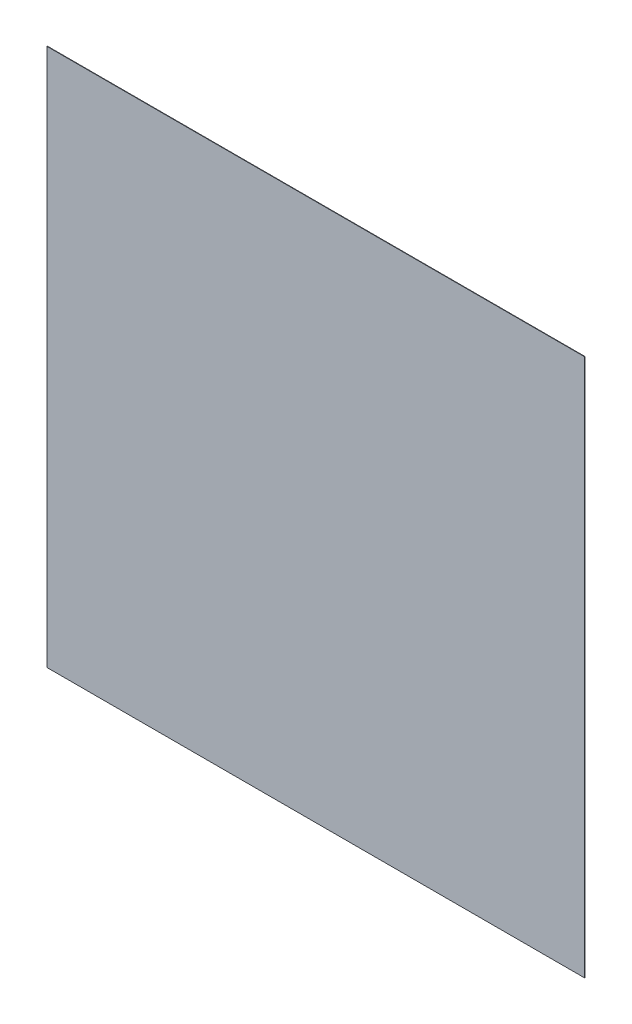
ISO-10303-21;
HEADER;
FILE_DESCRIPTION(('STEP AP214'),'2;1');
FILE_NAME('part.step','',(''),(''),'','','');
FILE_SCHEMA(('AUTOMOTIVE_DESIGN { 1 0 10303 214 1 1 1 1 }'));
ENDSEC;
DATA;
#1=APPLICATION_CONTEXT('core data for automotive mechanical design processes');
#2=APPLICATION_PROTOCOL_DEFINITION('international standard','automotive_design',2000,#1);
#3=PRODUCT_CONTEXT('',#1,'mechanical');
#4=PRODUCT('Part','Part','',(#3));
#5=PRODUCT_RELATED_PRODUCT_CATEGORY('part','',(#4));
#6=PRODUCT_DEFINITION_FORMATION('','',#4);
#7=PRODUCT_DEFINITION_CONTEXT('part definition',#1,'design');
#8=PRODUCT_DEFINITION('design','',#6,#7);
#9=PRODUCT_DEFINITION_SHAPE('','',#8);
#10=(LENGTH_UNIT() NAMED_UNIT(*) SI_UNIT(.MILLI.,.METRE.));
#11=(NAMED_UNIT(*) PLANE_ANGLE_UNIT() SI_UNIT($,.RADIAN.));
#12=(NAMED_UNIT(*) SI_UNIT($,.STERADIAN.) SOLID_ANGLE_UNIT());
#13=UNCERTAINTY_MEASURE_WITH_UNIT(LENGTH_MEASURE(1.E-05),#10,'distance_accuracy_value','');
#14=(GEOMETRIC_REPRESENTATION_CONTEXT(3) GLOBAL_UNCERTAINTY_ASSIGNED_CONTEXT((#13)) GLOBAL_UNIT_ASSIGNED_CONTEXT((#10,
#11,#12)) REPRESENTATION_CONTEXT('',''));
#15=CARTESIAN_POINT('',(0.,0.,0.));
#16=DIRECTION('',(0.,0.,1.));
#17=DIRECTION('',(1.,0.,0.));
#18=AXIS2_PLACEMENT_3D('',#15,#16,#17);
#19=CARTESIAN_POINT('',(1524.,1524.,2.54));
#20=DIRECTION('',(-1.,0.,0.));
#21=DIRECTION('',(0.,-1.,0.));
#22=AXIS2_PLACEMENT_3D('',#19,#20,#21);
#23=PLANE('',#22);
#24=DIRECTION('',(0.,1.,0.));
#25=VECTOR('',#24,1.);
#26=CARTESIAN_POINT('',(1524.,1524.,0.));
#27=LINE('',#26,#25);
#28=CARTESIAN_POINT('',(1524.,-1524.,0.));
#29=VERTEX_POINT('',#28);
#30=CARTESIAN_POINT('',(1524.,1524.,0.));
#31=VERTEX_POINT('',#30);
#32=EDGE_CURVE('E111',#29,#31,#27,.T.);
#33=ORIENTED_EDGE('',*,*,#32,.T.);
#34=DIRECTION('',(0.,0.,-1.));
#35=VECTOR('',#34,1.);
#36=CARTESIAN_POINT('',(1524.,1524.,2.54));
#37=LINE('',#36,#35);
#38=CARTESIAN_POINT('',(1524.,1524.,2.54));
#39=VERTEX_POINT('',#38);
#40=EDGE_CURVE('E11',#39,#31,#37,.T.);
#41=ORIENTED_EDGE('',*,*,#40,.F.);
#42=DIRECTION('',(0.,1.,0.));
#43=VECTOR('',#42,1.);
#44=CARTESIAN_POINT('',(1524.,1524.,2.54));
#45=LINE('',#44,#43);
#46=CARTESIAN_POINT('',(1524.,-1524.,2.54));
#47=VERTEX_POINT('',#46);
#48=EDGE_CURVE('E95',#47,#39,#45,.T.);
#49=ORIENTED_EDGE('',*,*,#48,.F.);
#50=DIRECTION('',(0.,0.,-1.));
#51=VECTOR('',#50,1.);
#52=CARTESIAN_POINT('',(1524.,-1524.,2.54));
#53=LINE('',#52,#51);
#54=EDGE_CURVE('E107',#47,#29,#53,.T.);
#55=ORIENTED_EDGE('',*,*,#54,.T.);
#56=EDGE_LOOP('',(#33,#41,#49,#55));
#57=FACE_BOUND('',#56,.T.);
#58=ADVANCED_FACE('F43',(#57),#23,.F.);
#59=CARTESIAN_POINT('',(-1524.,1524.,2.54));
#60=DIRECTION('',(0.,-1.,0.));
#61=DIRECTION('',(0.,0.,-1.));
#62=AXIS2_PLACEMENT_3D('',#59,#60,#61);
#63=PLANE('',#62);
#64=DIRECTION('',(-1.,0.,0.));
#65=VECTOR('',#64,1.);
#66=CARTESIAN_POINT('',(-1524.,1524.,0.));
#67=LINE('',#66,#65);
#68=CARTESIAN_POINT('',(-1524.,1524.,0.));
#69=VERTEX_POINT('',#68);
#70=EDGE_CURVE('E100',#31,#69,#67,.T.);
#71=ORIENTED_EDGE('',*,*,#70,.T.);
#72=DIRECTION('',(0.,0.,-1.));
#73=VECTOR('',#72,1.);
#74=CARTESIAN_POINT('',(-1524.,1524.,2.54));
#75=LINE('',#74,#73);
#76=CARTESIAN_POINT('',(-1524.,1524.,2.54));
#77=VERTEX_POINT('',#76);
#78=EDGE_CURVE('E52',#77,#69,#75,.T.);
#79=ORIENTED_EDGE('',*,*,#78,.F.);
#80=DIRECTION('',(-1.,0.,0.));
#81=VECTOR('',#80,1.);
#82=CARTESIAN_POINT('',(-1524.,1524.,2.54));
#83=LINE('',#82,#81);
#84=EDGE_CURVE('E90',#39,#77,#83,.T.);
#85=ORIENTED_EDGE('',*,*,#84,.F.);
#86=ORIENTED_EDGE('',*,*,#40,.T.);
#87=EDGE_LOOP('',(#71,#79,#85,#86));
#88=FACE_BOUND('',#87,.T.);
#89=ADVANCED_FACE('F99',(#88),#63,.F.);
#90=CARTESIAN_POINT('',(-1524.,1524.,2.54));
#91=DIRECTION('',(1.,0.,0.));
#92=DIRECTION('',(0.,1.,0.));
#93=AXIS2_PLACEMENT_3D('',#90,#91,#92);
#94=PLANE('',#93);
#95=DIRECTION('',(0.,-1.,0.));
#96=VECTOR('',#95,1.);
#97=CARTESIAN_POINT('',(-1524.,1524.,0.));
#98=LINE('',#97,#96);
#99=CARTESIAN_POINT('',(-1524.,-1524.,0.));
#100=VERTEX_POINT('',#99);
#101=EDGE_CURVE('E77',#69,#100,#98,.T.);
#102=ORIENTED_EDGE('',*,*,#101,.T.);
#103=DIRECTION('',(0.,0.,-1.));
#104=VECTOR('',#103,1.);
#105=CARTESIAN_POINT('',(-1524.,-1524.,2.54));
#106=LINE('',#105,#104);
#107=CARTESIAN_POINT('',(-1524.,-1524.,2.54));
#108=VERTEX_POINT('',#107);
#109=EDGE_CURVE('E102',#108,#100,#106,.T.);
#110=ORIENTED_EDGE('',*,*,#109,.F.);
#111=DIRECTION('',(0.,-1.,0.));
#112=VECTOR('',#111,1.);
#113=CARTESIAN_POINT('',(-1524.,1524.,2.54));
#114=LINE('',#113,#112);
#115=EDGE_CURVE('E93',#77,#108,#114,.T.);
#116=ORIENTED_EDGE('',*,*,#115,.F.);
#117=ORIENTED_EDGE('',*,*,#78,.T.);
#118=EDGE_LOOP('',(#102,#110,#116,#117));
#119=FACE_BOUND('',#118,.T.);
#120=ADVANCED_FACE('F103',(#119),#94,.F.);
#121=CARTESIAN_POINT('',(-1524.,-1524.,2.54));
#122=DIRECTION('',(0.,1.,0.));
#123=DIRECTION('',(0.,0.,1.));
#124=AXIS2_PLACEMENT_3D('',#121,#122,#123);
#125=PLANE('',#124);
#126=DIRECTION('',(1.,0.,0.));
#127=VECTOR('',#126,1.);
#128=CARTESIAN_POINT('',(-1524.,-1524.,0.));
#129=LINE('',#128,#127);
#130=EDGE_CURVE('E83',#100,#29,#129,.T.);
#131=ORIENTED_EDGE('',*,*,#130,.T.);
#132=ORIENTED_EDGE('',*,*,#54,.F.);
#133=DIRECTION('',(1.,0.,0.));
#134=VECTOR('',#133,1.);
#135=CARTESIAN_POINT('',(-1524.,-1524.,2.54));
#136=LINE('',#135,#134);
#137=EDGE_CURVE('E60',#108,#47,#136,.T.);
#138=ORIENTED_EDGE('',*,*,#137,.F.);
#139=ORIENTED_EDGE('',*,*,#109,.T.);
#140=EDGE_LOOP('',(#131,#132,#138,#139));
#141=FACE_BOUND('',#140,.T.);
#142=ADVANCED_FACE('F124',(#141),#125,.F.);
#143=CARTESIAN_POINT('',(0.,0.,2.54));
#144=DIRECTION('',(0.,0.,1.));
#145=DIRECTION('',(1.,0.,0.));
#146=AXIS2_PLACEMENT_3D('',#143,#144,#145);
#147=PLANE('',#146);
#148=ORIENTED_EDGE('',*,*,#48,.T.);
#149=ORIENTED_EDGE('',*,*,#84,.T.);
#150=ORIENTED_EDGE('',*,*,#115,.T.);
#151=ORIENTED_EDGE('',*,*,#137,.T.);
#152=EDGE_LOOP('',(#148,#149,#150,#151));
#153=FACE_BOUND('',#152,.T.);
#154=ADVANCED_FACE('F91',(#153),#147,.T.);
#155=CARTESIAN_POINT('',(0.,0.,0.));
#156=DIRECTION('',(0.,0.,1.));
#157=DIRECTION('',(1.,0.,0.));
#158=AXIS2_PLACEMENT_3D('',#155,#156,#157);
#159=PLANE('',#158);
#160=ORIENTED_EDGE('',*,*,#32,.F.);
#161=ORIENTED_EDGE('',*,*,#130,.F.);
#162=ORIENTED_EDGE('',*,*,#101,.F.);
#163=ORIENTED_EDGE('',*,*,#70,.F.);
#164=EDGE_LOOP('',(#160,#161,#162,#163));
#165=FACE_BOUND('',#164,.T.);
#166=ADVANCED_FACE('F127',(#165),#159,.F.);
#167=CLOSED_SHELL('',(#58,#89,#120,#142,#154,#166));
#168=MANIFOLD_SOLID_BREP('B2',#167);
#169=ADVANCED_BREP_SHAPE_REPRESENTATION('',(#18,#168),#14);
#170=SHAPE_DEFINITION_REPRESENTATION(#9,#169);
ENDSEC;
END-ISO-10303-21;
